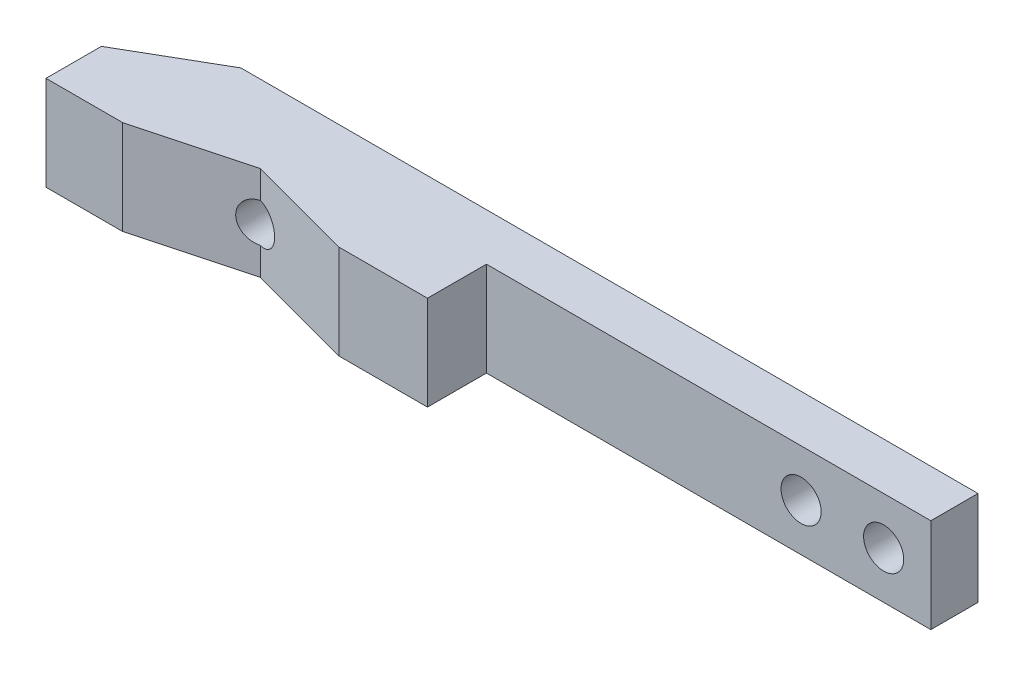
ISO-10303-21;
HEADER;
FILE_DESCRIPTION(('STEP AP214'),'2;1');
FILE_NAME('part.step','',(''),(''),'','','');
FILE_SCHEMA(('AUTOMOTIVE_DESIGN { 1 0 10303 214 1 1 1 1 }'));
ENDSEC;
DATA;
#1=APPLICATION_CONTEXT('core data for automotive mechanical design processes');
#2=APPLICATION_PROTOCOL_DEFINITION('international standard','automotive_design',2000,#1);
#3=PRODUCT_CONTEXT('',#1,'mechanical');
#4=PRODUCT('Part','Part','',(#3));
#5=PRODUCT_RELATED_PRODUCT_CATEGORY('part','',(#4));
#6=PRODUCT_DEFINITION_FORMATION('','',#4);
#7=PRODUCT_DEFINITION_CONTEXT('part definition',#1,'design');
#8=PRODUCT_DEFINITION('design','',#6,#7);
#9=PRODUCT_DEFINITION_SHAPE('','',#8);
#10=(LENGTH_UNIT() NAMED_UNIT(*) SI_UNIT(.MILLI.,.METRE.));
#11=(NAMED_UNIT(*) PLANE_ANGLE_UNIT() SI_UNIT($,.RADIAN.));
#12=(NAMED_UNIT(*) SI_UNIT($,.STERADIAN.) SOLID_ANGLE_UNIT());
#13=UNCERTAINTY_MEASURE_WITH_UNIT(LENGTH_MEASURE(1.E-05),#10,'distance_accuracy_value','');
#14=(GEOMETRIC_REPRESENTATION_CONTEXT(3) GLOBAL_UNCERTAINTY_ASSIGNED_CONTEXT((#13)) GLOBAL_UNIT_ASSIGNED_CONTEXT((#10,
#11,#12)) REPRESENTATION_CONTEXT('',''));
#15=CARTESIAN_POINT('',(0.,0.,0.));
#16=DIRECTION('',(0.,0.,1.));
#17=DIRECTION('',(1.,0.,0.));
#18=AXIS2_PLACEMENT_3D('',#15,#16,#17);
#19=CARTESIAN_POINT('',(-2.2832496067622,8.,3.78779380406026));
#20=DIRECTION('',(0.,0.,-1.));
#21=DIRECTION('',(-1.,0.,0.));
#22=AXIS2_PLACEMENT_3D('',#19,#20,#21);
#23=PLANE('',#22);
#24=CARTESIAN_POINT('',(31.3970466845081,4.,3.78779380406026));
#25=DIRECTION('',(0.,0.,-1.));
#26=DIRECTION('',(-1.,0.,0.));
#27=AXIS2_PLACEMENT_3D('',#24,#25,#26);
#28=CIRCLE('',#27,1.7);
#29=CARTESIAN_POINT('',(29.6970466845081,4.,3.78779380406026));
#30=VERTEX_POINT('',#29);
#31=EDGE_CURVE('E297',#30,#30,#28,.T.);
#32=ORIENTED_EDGE('',*,*,#31,.T.);
#33=EDGE_LOOP('',(#32));
#34=FACE_BOUND('',#33,.T.);
#35=CARTESIAN_POINT('',(24.3970466845081,4.,3.78779380406026));
#36=DIRECTION('',(0.,0.,-1.));
#37=DIRECTION('',(-1.,0.,0.));
#38=AXIS2_PLACEMENT_3D('',#35,#36,#37);
#39=CIRCLE('',#38,1.7);
#40=CARTESIAN_POINT('',(22.6970466845081,4.,3.78779380406026));
#41=VERTEX_POINT('',#40);
#42=EDGE_CURVE('E301',#41,#41,#39,.T.);
#43=ORIENTED_EDGE('',*,*,#42,.T.);
#44=EDGE_LOOP('',(#43));
#45=FACE_BOUND('',#44,.T.);
#46=DIRECTION('',(1.,0.,0.));
#47=VECTOR('',#46,1.);
#48=CARTESIAN_POINT('',(-2.2832496067622,0.,3.78779380406026));
#49=LINE('',#48,#47);
#50=CARTESIAN_POINT('',(-2.2832496067622,0.,3.78779380406026));
#51=VERTEX_POINT('',#50);
#52=CARTESIAN_POINT('',(35.3970466845081,0.,3.78779380406026));
#53=VERTEX_POINT('',#52);
#54=EDGE_CURVE('E166',#51,#53,#49,.T.);
#55=ORIENTED_EDGE('',*,*,#54,.T.);
#56=DIRECTION('',(0.,-1.,0.));
#57=VECTOR('',#56,1.);
#58=CARTESIAN_POINT('',(35.3970466845081,8.,3.78779380406026));
#59=LINE('',#58,#57);
#60=CARTESIAN_POINT('',(35.3970466845081,8.,3.78779380406026));
#61=VERTEX_POINT('',#60);
#62=EDGE_CURVE('E51',#61,#53,#59,.T.);
#63=ORIENTED_EDGE('',*,*,#62,.F.);
#64=DIRECTION('',(1.,0.,0.));
#65=VECTOR('',#64,1.);
#66=CARTESIAN_POINT('',(-2.2832496067622,8.,3.78779380406026));
#67=LINE('',#66,#65);
#68=CARTESIAN_POINT('',(-2.2832496067622,8.,3.78779380406026));
#69=VERTEX_POINT('',#68);
#70=EDGE_CURVE('E196',#69,#61,#67,.T.);
#71=ORIENTED_EDGE('',*,*,#70,.F.);
#72=DIRECTION('',(0.,-1.,0.));
#73=VECTOR('',#72,1.);
#74=CARTESIAN_POINT('',(-2.2832496067622,8.,3.78779380406026));
#75=LINE('',#74,#73);
#76=EDGE_CURVE('E162',#69,#51,#75,.T.);
#77=ORIENTED_EDGE('',*,*,#76,.T.);
#78=EDGE_LOOP('',(#55,#63,#71,#77));
#79=FACE_BOUND('',#78,.T.);
#80=ADVANCED_FACE('F43',(#34,#45,#79),#23,.F.);
#81=CARTESIAN_POINT('',(35.3970466845081,8.,-0.212206195939745));
#82=DIRECTION('',(-1.,0.,0.));
#83=DIRECTION('',(0.,0.,1.));
#84=AXIS2_PLACEMENT_3D('',#81,#82,#83);
#85=PLANE('',#84);
#86=DIRECTION('',(0.,0.,-1.));
#87=VECTOR('',#86,1.);
#88=CARTESIAN_POINT('',(35.3970466845081,0.,-0.212206195939745));
#89=LINE('',#88,#87);
#90=CARTESIAN_POINT('',(35.3970466845081,0.,-0.212206195939745));
#91=VERTEX_POINT('',#90);
#92=EDGE_CURVE('E170',#53,#91,#89,.T.);
#93=ORIENTED_EDGE('',*,*,#92,.T.);
#94=DIRECTION('',(0.,-1.,0.));
#95=VECTOR('',#94,1.);
#96=CARTESIAN_POINT('',(35.3970466845081,8.,-0.212206195939745));
#97=LINE('',#96,#95);
#98=CARTESIAN_POINT('',(35.3970466845081,8.,-0.212206195939745));
#99=VERTEX_POINT('',#98);
#100=EDGE_CURVE('E220',#99,#91,#97,.T.);
#101=ORIENTED_EDGE('',*,*,#100,.F.);
#102=DIRECTION('',(0.,0.,-1.));
#103=VECTOR('',#102,1.);
#104=CARTESIAN_POINT('',(35.3970466845081,8.,-0.212206195939745));
#105=LINE('',#104,#103);
#106=EDGE_CURVE('E113',#61,#99,#105,.T.);
#107=ORIENTED_EDGE('',*,*,#106,.F.);
#108=ORIENTED_EDGE('',*,*,#62,.T.);
#109=EDGE_LOOP('',(#93,#101,#107,#108));
#110=FACE_BOUND('',#109,.T.);
#111=ADVANCED_FACE('F226',(#110),#85,.F.);
#112=CARTESIAN_POINT('',(35.3970466845081,8.,-0.212206195939745));
#113=DIRECTION('',(0.,0.,1.));
#114=DIRECTION('',(1.,0.,0.));
#115=AXIS2_PLACEMENT_3D('',#112,#113,#114);
#116=PLANE('',#115);
#117=CARTESIAN_POINT('',(31.3970466845081,4.,-0.212206195939743));
#118=DIRECTION('',(0.,0.,-1.));
#119=DIRECTION('',(-1.,0.,0.));
#120=AXIS2_PLACEMENT_3D('',#117,#118,#119);
#121=CIRCLE('',#120,1.7);
#122=CARTESIAN_POINT('',(29.6970466845081,4.,-0.212206195939743));
#123=VERTEX_POINT('',#122);
#124=EDGE_CURVE('E305',#123,#123,#121,.T.);
#125=ORIENTED_EDGE('',*,*,#124,.F.);
#126=EDGE_LOOP('',(#125));
#127=FACE_BOUND('',#126,.T.);
#128=CARTESIAN_POINT('',(24.3970466845081,4.,-0.212206195939741));
#129=DIRECTION('',(0.,0.,-1.));
#130=DIRECTION('',(-1.,0.,0.));
#131=AXIS2_PLACEMENT_3D('',#128,#129,#130);
#132=CIRCLE('',#131,1.7);
#133=CARTESIAN_POINT('',(22.6970466845081,4.,-0.21220619593974));
#134=VERTEX_POINT('',#133);
#135=EDGE_CURVE('E306',#134,#134,#132,.T.);
#136=ORIENTED_EDGE('',*,*,#135,.F.);
#137=EDGE_LOOP('',(#136));
#138=FACE_BOUND('',#137,.T.);
#139=CARTESIAN_POINT('',(-18.8929333436745,4.,-0.212206195939724));
#140=DIRECTION('',(0.,0.,-1.));
#141=DIRECTION('',(-1.,0.,0.));
#142=AXIS2_PLACEMENT_3D('',#139,#140,#141);
#143=CIRCLE('',#142,1.65);
#144=CARTESIAN_POINT('',(-20.5429333436745,4.,-0.212206195939724));
#145=VERTEX_POINT('',#144);
#146=EDGE_CURVE('E274',#145,#145,#143,.T.);
#147=ORIENTED_EDGE('',*,*,#146,.F.);
#148=EDGE_LOOP('',(#147));
#149=FACE_BOUND('',#148,.T.);
#150=DIRECTION('',(-1.,0.,0.));
#151=VECTOR('',#150,1.);
#152=CARTESIAN_POINT('',(35.3970466845081,0.,-0.212206195939745));
#153=LINE('',#152,#151);
#154=CARTESIAN_POINT('',(-27.1033025550541,0.,-0.21220619593972));
#155=VERTEX_POINT('',#154);
#156=EDGE_CURVE('E173',#91,#155,#153,.T.);
#157=ORIENTED_EDGE('',*,*,#156,.T.);
#158=DIRECTION('',(0.,-1.,0.));
#159=VECTOR('',#158,1.);
#160=CARTESIAN_POINT('',(-27.1033025550541,8.,-0.21220619593972));
#161=LINE('',#160,#159);
#162=CARTESIAN_POINT('',(-27.1033025550541,8.,-0.21220619593972));
#163=VERTEX_POINT('',#162);
#164=EDGE_CURVE('E216',#163,#155,#161,.T.);
#165=ORIENTED_EDGE('',*,*,#164,.F.);
#166=DIRECTION('',(-1.,0.,0.));
#167=VECTOR('',#166,1.);
#168=CARTESIAN_POINT('',(35.3970466845081,8.,-0.212206195939745));
#169=LINE('',#168,#167);
#170=EDGE_CURVE('E247',#99,#163,#169,.T.);
#171=ORIENTED_EDGE('',*,*,#170,.F.);
#172=ORIENTED_EDGE('',*,*,#100,.T.);
#173=EDGE_LOOP('',(#157,#165,#171,#172));
#174=FACE_BOUND('',#173,.T.);
#175=ADVANCED_FACE('F237',(#127,#138,#149,#174),#116,.F.);
#176=CARTESIAN_POINT('',(-34.6029333436745,8.,4.11770765869308));
#177=DIRECTION('',(0.500000000000004,0.,0.866025403784436));
#178=DIRECTION('',(0.866025403784436,0.,-0.500000000000004));
#179=AXIS2_PLACEMENT_3D('',#176,#177,#178);
#180=PLANE('',#179);
#181=DIRECTION('',(-0.866025403784436,0.,0.500000000000004));
#182=VECTOR('',#181,1.);
#183=CARTESIAN_POINT('',(-34.6029333436745,0.,4.11770765869308));
#184=LINE('',#183,#182);
#185=CARTESIAN_POINT('',(-34.6029333436745,0.,4.11770765869308));
#186=VERTEX_POINT('',#185);
#187=EDGE_CURVE('E176',#155,#186,#184,.T.);
#188=ORIENTED_EDGE('',*,*,#187,.T.);
#189=DIRECTION('',(0.,-1.,0.));
#190=VECTOR('',#189,1.);
#191=CARTESIAN_POINT('',(-34.6029333436745,8.,4.11770765869308));
#192=LINE('',#191,#190);
#193=CARTESIAN_POINT('',(-34.6029333436745,8.,4.11770765869308));
#194=VERTEX_POINT('',#193);
#195=EDGE_CURVE('E212',#194,#186,#192,.T.);
#196=ORIENTED_EDGE('',*,*,#195,.F.);
#197=DIRECTION('',(-0.866025403784436,0.,0.500000000000004));
#198=VECTOR('',#197,1.);
#199=CARTESIAN_POINT('',(-34.6029333436745,8.,4.11770765869308));
#200=LINE('',#199,#198);
#201=EDGE_CURVE('E243',#163,#194,#200,.T.);
#202=ORIENTED_EDGE('',*,*,#201,.F.);
#203=ORIENTED_EDGE('',*,*,#164,.T.);
#204=EDGE_LOOP('',(#188,#196,#202,#203));
#205=FACE_BOUND('',#204,.T.);
#206=ADVANCED_FACE('F241',(#205),#180,.F.);
#207=CARTESIAN_POINT('',(-34.6029333436745,8.,4.11770765869308));
#208=DIRECTION('',(1.,0.,0.));
#209=DIRECTION('',(0.,0.,-1.));
#210=AXIS2_PLACEMENT_3D('',#207,#208,#209);
#211=PLANE('',#210);
#212=DIRECTION('',(0.,0.,1.));
#213=VECTOR('',#212,1.);
#214=CARTESIAN_POINT('',(-34.6029333436745,0.,4.11770765869308));
#215=LINE('',#214,#213);
#216=CARTESIAN_POINT('',(-34.6029333436745,0.,8.8148447773574));
#217=VERTEX_POINT('',#216);
#218=EDGE_CURVE('E179',#186,#217,#215,.T.);
#219=ORIENTED_EDGE('',*,*,#218,.T.);
#220=DIRECTION('',(0.,-1.,0.));
#221=VECTOR('',#220,1.);
#222=CARTESIAN_POINT('',(-34.6029333436745,8.,8.8148447773574));
#223=LINE('',#222,#221);
#224=CARTESIAN_POINT('',(-34.6029333436745,8.,8.8148447773574));
#225=VERTEX_POINT('',#224);
#226=EDGE_CURVE('E208',#225,#217,#223,.T.);
#227=ORIENTED_EDGE('',*,*,#226,.F.);
#228=DIRECTION('',(0.,0.,1.));
#229=VECTOR('',#228,1.);
#230=CARTESIAN_POINT('',(-34.6029333436745,8.,4.11770765869308));
#231=LINE('',#230,#229);
#232=EDGE_CURVE('E246',#194,#225,#231,.T.);
#233=ORIENTED_EDGE('',*,*,#232,.F.);
#234=ORIENTED_EDGE('',*,*,#195,.T.);
#235=EDGE_LOOP('',(#219,#227,#233,#234));
#236=FACE_BOUND('',#235,.T.);
#237=ADVANCED_FACE('F414',(#236),#211,.F.);
#238=CARTESIAN_POINT('',(-34.6029333436745,8.,8.8148447773574));
#239=DIRECTION('',(0.,0.,-1.));
#240=DIRECTION('',(-1.,0.,0.));
#241=AXIS2_PLACEMENT_3D('',#238,#239,#240);
#242=PLANE('',#241);
#243=DIRECTION('',(1.,0.,0.));
#244=VECTOR('',#243,1.);
#245=CARTESIAN_POINT('',(-34.6029333436745,0.,8.8148447773574));
#246=LINE('',#245,#244);
#247=CARTESIAN_POINT('',(-28.1029333436745,0.,8.8148447773574));
#248=VERTEX_POINT('',#247);
#249=EDGE_CURVE('E182',#217,#248,#246,.T.);
#250=ORIENTED_EDGE('',*,*,#249,.T.);
#251=DIRECTION('',(0.,-1.,0.));
#252=VECTOR('',#251,1.);
#253=CARTESIAN_POINT('',(-28.1029333436745,8.,8.8148447773574));
#254=LINE('',#253,#252);
#255=CARTESIAN_POINT('',(-28.1029333436745,8.,8.8148447773574));
#256=VERTEX_POINT('',#255);
#257=EDGE_CURVE('E204',#256,#248,#254,.T.);
#258=ORIENTED_EDGE('',*,*,#257,.F.);
#259=DIRECTION('',(1.,0.,0.));
#260=VECTOR('',#259,1.);
#261=CARTESIAN_POINT('',(-34.6029333436745,8.,8.8148447773574));
#262=LINE('',#261,#260);
#263=EDGE_CURVE('E252',#225,#256,#262,.T.);
#264=ORIENTED_EDGE('',*,*,#263,.F.);
#265=ORIENTED_EDGE('',*,*,#226,.T.);
#266=EDGE_LOOP('',(#250,#258,#264,#265));
#267=FACE_BOUND('',#266,.T.);
#268=ADVANCED_FACE('F267',(#267),#242,.F.);
#269=CARTESIAN_POINT('',(-28.1029333436745,8.,8.8148447773574));
#270=DIRECTION('',(-0.258819045102521,0.,-0.965925826289068));
#271=DIRECTION('',(-0.965925826289068,0.,0.258819045102521));
#272=AXIS2_PLACEMENT_3D('',#269,#270,#271);
#273=PLANE('',#272);
#274=DIRECTION('',(0.,-1.,0.));
#275=VECTOR('',#274,1.);
#276=CARTESIAN_POINT('',(-18.8926136718488,8.,6.34694705925922));
#277=LINE('',#276,#275);
#278=CARTESIAN_POINT('',(-18.8926136718488,2.35000003096669,6.34694705925922));
#279=VERTEX_POINT('',#278);
#280=CARTESIAN_POINT('',(-18.8926136718488,0.,6.34694705925922));
#281=VERTEX_POINT('',#280);
#282=EDGE_CURVE('E154',#279,#281,#277,.T.);
#283=ORIENTED_EDGE('',*,*,#282,.F.);
#284=CARTESIAN_POINT('',(-18.8929333436745,4.,6.34703271506676));
#285=DIRECTION('',(-0.258819045102521,0.,-0.965925826289068));
#286=DIRECTION('',(0.965925826289068,0.,-0.258819045102521));
#287=AXIS2_PLACEMENT_3D('',#284,#285,#286);
#288=ELLIPSE('',#287,1.70820569767664,1.65);
#289=CARTESIAN_POINT('',(-18.8926136718488,5.64999996903331,6.34694705925922));
#290=VERTEX_POINT('',#289);
#291=EDGE_CURVE('E11',#279,#290,#288,.T.);
#292=ORIENTED_EDGE('',*,*,#291,.T.);
#293=CARTESIAN_POINT('',(-18.8926136718488,8.,6.34694705925922));
#294=VERTEX_POINT('',#293);
#295=EDGE_CURVE('E201',#294,#290,#277,.T.);
#296=ORIENTED_EDGE('',*,*,#295,.F.);
#297=DIRECTION('',(0.965925826289068,0.,-0.258819045102521));
#298=VECTOR('',#297,1.);
#299=CARTESIAN_POINT('',(-28.1029333436745,8.,8.8148447773574));
#300=LINE('',#299,#298);
#301=EDGE_CURVE('E140',#256,#294,#300,.T.);
#302=ORIENTED_EDGE('',*,*,#301,.F.);
#303=ORIENTED_EDGE('',*,*,#257,.T.);
#304=DIRECTION('',(0.965925826289068,0.,-0.258819045102521));
#305=VECTOR('',#304,1.);
#306=CARTESIAN_POINT('',(-28.1029333436745,0.,8.8148447773574));
#307=LINE('',#306,#305);
#308=EDGE_CURVE('E185',#248,#281,#307,.T.);
#309=ORIENTED_EDGE('',*,*,#308,.T.);
#310=EDGE_LOOP('',(#283,#292,#296,#302,#303,#309));
#311=FACE_BOUND('',#310,.T.);
#312=ADVANCED_FACE('F272',(#311),#273,.F.);
#313=CARTESIAN_POINT('',(-9.7832496067622,8.,8.7877938040602));
#314=DIRECTION('',(0.258819045102515,0.,-0.96592582628907));
#315=DIRECTION('',(-0.96592582628907,0.,-0.258819045102515));
#316=AXIS2_PLACEMENT_3D('',#313,#314,#315);
#317=PLANE('',#316);
#318=ORIENTED_EDGE('',*,*,#295,.T.);
#319=CARTESIAN_POINT('',(-18.8929333436745,4.,6.34686140345169));
#320=DIRECTION('',(0.258819045102515,0.,-0.96592582628907));
#321=DIRECTION('',(-0.96592582628907,0.,-0.258819045102515));
#322=AXIS2_PLACEMENT_3D('',#319,#320,#321);
#323=ELLIPSE('',#322,1.70820569767663,1.65);
#324=EDGE_CURVE('E57',#290,#279,#323,.T.);
#325=ORIENTED_EDGE('',*,*,#324,.T.);
#326=ORIENTED_EDGE('',*,*,#282,.T.);
#327=DIRECTION('',(0.96592582628907,0.,0.258819045102515));
#328=VECTOR('',#327,1.);
#329=CARTESIAN_POINT('',(-9.7832496067622,0.,8.7877938040602));
#330=LINE('',#329,#328);
#331=CARTESIAN_POINT('',(-9.7832496067622,0.,8.7877938040602));
#332=VERTEX_POINT('',#331);
#333=EDGE_CURVE('E150',#281,#332,#330,.T.);
#334=ORIENTED_EDGE('',*,*,#333,.T.);
#335=DIRECTION('',(0.,-1.,0.));
#336=VECTOR('',#335,1.);
#337=CARTESIAN_POINT('',(-9.7832496067622,8.,8.7877938040602));
#338=LINE('',#337,#336);
#339=CARTESIAN_POINT('',(-9.7832496067622,8.,8.7877938040602));
#340=VERTEX_POINT('',#339);
#341=EDGE_CURVE('E147',#340,#332,#338,.T.);
#342=ORIENTED_EDGE('',*,*,#341,.F.);
#343=DIRECTION('',(0.96592582628907,0.,0.258819045102515));
#344=VECTOR('',#343,1.);
#345=CARTESIAN_POINT('',(-9.7832496067622,8.,8.7877938040602));
#346=LINE('',#345,#344);
#347=EDGE_CURVE('E133',#294,#340,#346,.T.);
#348=ORIENTED_EDGE('',*,*,#347,.F.);
#349=EDGE_LOOP('',(#318,#325,#326,#334,#342,#348));
#350=FACE_BOUND('',#349,.T.);
#351=ADVANCED_FACE('F148',(#350),#317,.F.);
#352=CARTESIAN_POINT('',(-9.7832496067622,8.,8.7877938040602));
#353=DIRECTION('',(0.,0.,-1.));
#354=DIRECTION('',(-1.,0.,0.));
#355=AXIS2_PLACEMENT_3D('',#352,#353,#354);
#356=PLANE('',#355);
#357=DIRECTION('',(1.,0.,0.));
#358=VECTOR('',#357,1.);
#359=CARTESIAN_POINT('',(-9.7832496067622,0.,8.7877938040602));
#360=LINE('',#359,#358);
#361=CARTESIAN_POINT('',(-2.2832496067622,0.,8.7877938040602));
#362=VERTEX_POINT('',#361);
#363=EDGE_CURVE('E191',#332,#362,#360,.T.);
#364=ORIENTED_EDGE('',*,*,#363,.T.);
#365=DIRECTION('',(0.,-1.,0.));
#366=VECTOR('',#365,1.);
#367=CARTESIAN_POINT('',(-2.2832496067622,8.,8.7877938040602));
#368=LINE('',#367,#366);
#369=CARTESIAN_POINT('',(-2.2832496067622,8.,8.7877938040602));
#370=VERTEX_POINT('',#369);
#371=EDGE_CURVE('E155',#370,#362,#368,.T.);
#372=ORIENTED_EDGE('',*,*,#371,.F.);
#373=DIRECTION('',(1.,0.,0.));
#374=VECTOR('',#373,1.);
#375=CARTESIAN_POINT('',(-9.7832496067622,8.,8.7877938040602));
#376=LINE('',#375,#374);
#377=EDGE_CURVE('E137',#340,#370,#376,.T.);
#378=ORIENTED_EDGE('',*,*,#377,.F.);
#379=ORIENTED_EDGE('',*,*,#341,.T.);
#380=EDGE_LOOP('',(#364,#372,#378,#379));
#381=FACE_BOUND('',#380,.T.);
#382=ADVANCED_FACE('F157',(#381),#356,.F.);
#383=CARTESIAN_POINT('',(-2.2832496067622,8.,8.7877938040602));
#384=DIRECTION('',(-1.,0.,0.));
#385=DIRECTION('',(0.,0.,1.));
#386=AXIS2_PLACEMENT_3D('',#383,#384,#385);
#387=PLANE('',#386);
#388=DIRECTION('',(0.,0.,-1.));
#389=VECTOR('',#388,1.);
#390=CARTESIAN_POINT('',(-2.2832496067622,0.,8.7877938040602));
#391=LINE('',#390,#389);
#392=EDGE_CURVE('E104',#362,#51,#391,.T.);
#393=ORIENTED_EDGE('',*,*,#392,.T.);
#394=ORIENTED_EDGE('',*,*,#76,.F.);
#395=DIRECTION('',(0.,0.,-1.));
#396=VECTOR('',#395,1.);
#397=CARTESIAN_POINT('',(-2.2832496067622,8.,8.7877938040602));
#398=LINE('',#397,#396);
#399=EDGE_CURVE('E65',#370,#69,#398,.T.);
#400=ORIENTED_EDGE('',*,*,#399,.F.);
#401=ORIENTED_EDGE('',*,*,#371,.T.);
#402=EDGE_LOOP('',(#393,#394,#400,#401));
#403=FACE_BOUND('',#402,.T.);
#404=ADVANCED_FACE('F288',(#403),#387,.F.);
#405=CARTESIAN_POINT('',(0.,8.,0.));
#406=DIRECTION('',(0.,-1.,0.));
#407=DIRECTION('',(0.,0.,-1.));
#408=AXIS2_PLACEMENT_3D('',#405,#406,#407);
#409=PLANE('',#408);
#410=ORIENTED_EDGE('',*,*,#70,.T.);
#411=ORIENTED_EDGE('',*,*,#106,.T.);
#412=ORIENTED_EDGE('',*,*,#170,.T.);
#413=ORIENTED_EDGE('',*,*,#201,.T.);
#414=ORIENTED_EDGE('',*,*,#232,.T.);
#415=ORIENTED_EDGE('',*,*,#263,.T.);
#416=ORIENTED_EDGE('',*,*,#301,.T.);
#417=ORIENTED_EDGE('',*,*,#347,.T.);
#418=ORIENTED_EDGE('',*,*,#377,.T.);
#419=ORIENTED_EDGE('',*,*,#399,.T.);
#420=EDGE_LOOP('',(#410,#411,#412,#413,#414,#415,#416,#417,#418,#419));
#421=FACE_BOUND('',#420,.T.);
#422=ADVANCED_FACE('F135',(#421),#409,.F.);
#423=CARTESIAN_POINT('',(0.,0.,0.));
#424=DIRECTION('',(0.,-1.,0.));
#425=DIRECTION('',(0.,0.,-1.));
#426=AXIS2_PLACEMENT_3D('',#423,#424,#425);
#427=PLANE('',#426);
#428=ORIENTED_EDGE('',*,*,#54,.F.);
#429=ORIENTED_EDGE('',*,*,#392,.F.);
#430=ORIENTED_EDGE('',*,*,#363,.F.);
#431=ORIENTED_EDGE('',*,*,#333,.F.);
#432=ORIENTED_EDGE('',*,*,#308,.F.);
#433=ORIENTED_EDGE('',*,*,#249,.F.);
#434=ORIENTED_EDGE('',*,*,#218,.F.);
#435=ORIENTED_EDGE('',*,*,#187,.F.);
#436=ORIENTED_EDGE('',*,*,#156,.F.);
#437=ORIENTED_EDGE('',*,*,#92,.F.);
#438=EDGE_LOOP('',(#428,#429,#430,#431,#432,#433,#434,#435,#436,#437));
#439=FACE_BOUND('',#438,.T.);
#440=ADVANCED_FACE('F231',(#439),#427,.T.);
#441=CARTESIAN_POINT('',(-18.8929333436745,4.,-0.212206195939724));
#442=DIRECTION('',(0.,0.,-1.));
#443=DIRECTION('',(-1.,0.,0.));
#444=AXIS2_PLACEMENT_3D('',#441,#442,#443);
#445=CYLINDRICAL_SURFACE('',#444,1.65);
#446=ORIENTED_EDGE('',*,*,#146,.T.);
#447=EDGE_LOOP('',(#446));
#448=FACE_BOUND('',#447,.T.);
#449=ORIENTED_EDGE('',*,*,#291,.F.);
#450=ORIENTED_EDGE('',*,*,#324,.F.);
#451=EDGE_LOOP('',(#449,#450));
#452=FACE_BOUND('',#451,.T.);
#453=ADVANCED_FACE('F325',(#448,#452),#445,.F.);
#454=CARTESIAN_POINT('',(24.3970466845081,4.,9.78779380406026));
#455=DIRECTION('',(0.,0.,-1.));
#456=DIRECTION('',(-1.,0.,0.));
#457=AXIS2_PLACEMENT_3D('',#454,#455,#456);
#458=CYLINDRICAL_SURFACE('',#457,1.7);
#459=ORIENTED_EDGE('',*,*,#135,.T.);
#460=EDGE_LOOP('',(#459));
#461=FACE_BOUND('',#460,.T.);
#462=ORIENTED_EDGE('',*,*,#42,.F.);
#463=EDGE_LOOP('',(#462));
#464=FACE_BOUND('',#463,.T.);
#465=ADVANCED_FACE('F327',(#461,#464),#458,.F.);
#466=CARTESIAN_POINT('',(31.3970466845081,4.,9.78779380406026));
#467=DIRECTION('',(0.,0.,-1.));
#468=DIRECTION('',(-1.,0.,0.));
#469=AXIS2_PLACEMENT_3D('',#466,#467,#468);
#470=CYLINDRICAL_SURFACE('',#469,1.7);
#471=ORIENTED_EDGE('',*,*,#124,.T.);
#472=EDGE_LOOP('',(#471));
#473=FACE_BOUND('',#472,.T.);
#474=ORIENTED_EDGE('',*,*,#31,.F.);
#475=EDGE_LOOP('',(#474));
#476=FACE_BOUND('',#475,.T.);
#477=ADVANCED_FACE('F315',(#473,#476),#470,.F.);
#478=CLOSED_SHELL('',(#80,#111,#175,#206,#237,#268,#312,#351,#382,#404,#422,#440,#453,#465,#477));
#479=MANIFOLD_SOLID_BREP('B2',#478);
#480=ADVANCED_BREP_SHAPE_REPRESENTATION('',(#18,#479),#14);
#481=SHAPE_DEFINITION_REPRESENTATION(#9,#480);
ENDSEC;
END-ISO-10303-21;
